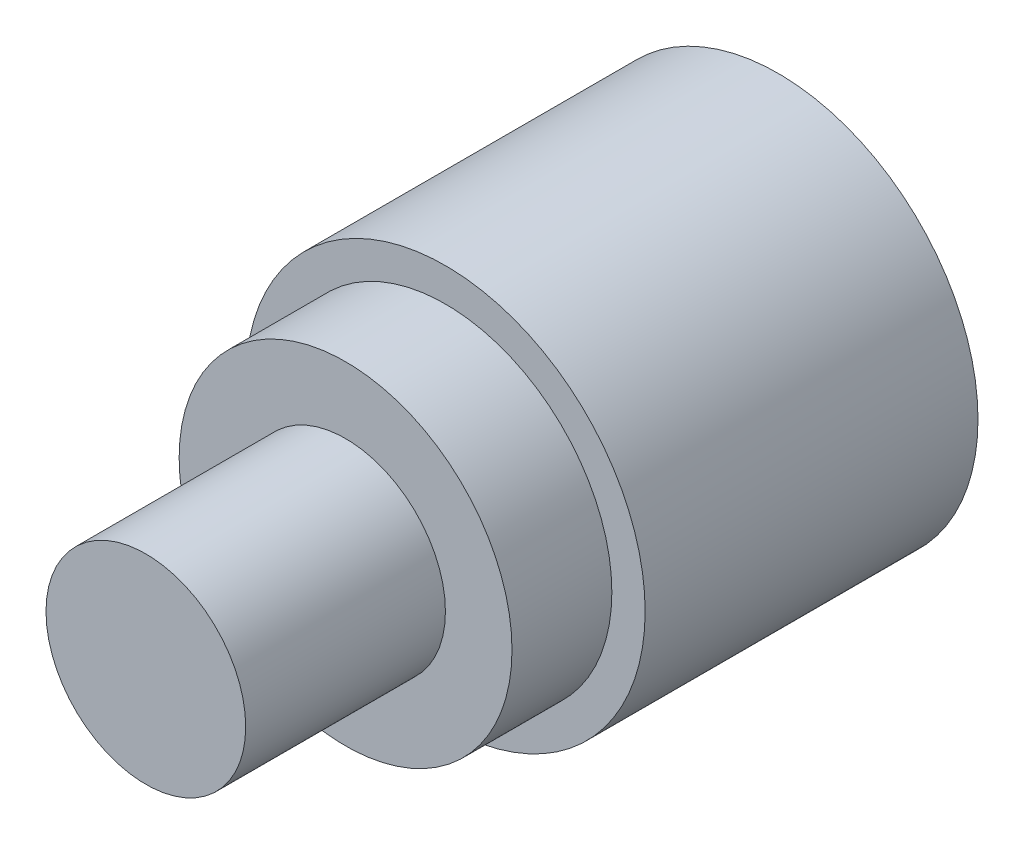
ISO-10303-21;
HEADER;
FILE_DESCRIPTION(('STEP AP214'),'2;1');
FILE_NAME('part.step','',(''),(''),'','','');
FILE_SCHEMA(('AUTOMOTIVE_DESIGN { 1 0 10303 214 1 1 1 1 }'));
ENDSEC;
DATA;
#1=APPLICATION_CONTEXT('core data for automotive mechanical design processes');
#2=APPLICATION_PROTOCOL_DEFINITION('international standard','automotive_design',2000,#1);
#3=PRODUCT_CONTEXT('',#1,'mechanical');
#4=PRODUCT('Part','Part','',(#3));
#5=PRODUCT_RELATED_PRODUCT_CATEGORY('part','',(#4));
#6=PRODUCT_DEFINITION_FORMATION('','',#4);
#7=PRODUCT_DEFINITION_CONTEXT('part definition',#1,'design');
#8=PRODUCT_DEFINITION('design','',#6,#7);
#9=PRODUCT_DEFINITION_SHAPE('','',#8);
#10=(LENGTH_UNIT() NAMED_UNIT(*) SI_UNIT(.MILLI.,.METRE.));
#11=(NAMED_UNIT(*) PLANE_ANGLE_UNIT() SI_UNIT($,.RADIAN.));
#12=(NAMED_UNIT(*) SI_UNIT($,.STERADIAN.) SOLID_ANGLE_UNIT());
#13=UNCERTAINTY_MEASURE_WITH_UNIT(LENGTH_MEASURE(1.E-05),#10,'distance_accuracy_value','');
#14=(GEOMETRIC_REPRESENTATION_CONTEXT(3) GLOBAL_UNCERTAINTY_ASSIGNED_CONTEXT((#13)) GLOBAL_UNIT_ASSIGNED_CONTEXT((#10,
#11,#12)) REPRESENTATION_CONTEXT('',''));
#15=CARTESIAN_POINT('',(0.,0.,0.));
#16=DIRECTION('',(0.,0.,1.));
#17=DIRECTION('',(1.,0.,0.));
#18=AXIS2_PLACEMENT_3D('',#15,#16,#17);
#19=CARTESIAN_POINT('',(0.,0.,40.));
#20=DIRECTION('',(0.,0.,1.));
#21=DIRECTION('',(1.,0.,0.));
#22=AXIS2_PLACEMENT_3D('',#19,#20,#21);
#23=PLANE('',#22);
#24=CARTESIAN_POINT('',(0.,0.,40.));
#25=DIRECTION('',(0.,0.,1.));
#26=DIRECTION('',(1.,0.,0.));
#27=AXIS2_PLACEMENT_3D('',#24,#25,#26);
#28=CIRCLE('',#27,25.);
#29=CARTESIAN_POINT('',(25.,0.,40.));
#30=VERTEX_POINT('',#29);
#31=EDGE_CURVE('E43',#30,#30,#28,.T.);
#32=ORIENTED_EDGE('',*,*,#31,.T.);
#33=EDGE_LOOP('',(#32));
#34=FACE_BOUND('',#33,.T.);
#35=CARTESIAN_POINT('',(0.,0.,40.));
#36=DIRECTION('',(0.,0.,1.));
#37=DIRECTION('',(1.,0.,0.));
#38=AXIS2_PLACEMENT_3D('',#35,#36,#37);
#39=CIRCLE('',#38,15.);
#40=CARTESIAN_POINT('',(15.,0.,40.));
#41=VERTEX_POINT('',#40);
#42=EDGE_CURVE('E51',#41,#41,#39,.T.);
#43=ORIENTED_EDGE('',*,*,#42,.F.);
#44=EDGE_LOOP('',(#43));
#45=FACE_BOUND('',#44,.T.);
#46=ADVANCED_FACE('F32',(#34,#45),#23,.T.);
#47=CARTESIAN_POINT('',(0.,0.,25.));
#48=DIRECTION('',(0.,0.,1.));
#49=DIRECTION('',(1.,0.,0.));
#50=AXIS2_PLACEMENT_3D('',#47,#48,#49);
#51=PLANE('',#50);
#52=CARTESIAN_POINT('',(0.,0.,25.));
#53=DIRECTION('',(0.,0.,1.));
#54=DIRECTION('',(1.,0.,0.));
#55=AXIS2_PLACEMENT_3D('',#52,#53,#54);
#56=CIRCLE('',#55,30.);
#57=CARTESIAN_POINT('',(30.,0.,25.));
#58=VERTEX_POINT('',#57);
#59=EDGE_CURVE('E10',#58,#58,#56,.T.);
#60=ORIENTED_EDGE('',*,*,#59,.T.);
#61=EDGE_LOOP('',(#60));
#62=FACE_BOUND('',#61,.T.);
#63=CARTESIAN_POINT('',(0.,0.,25.));
#64=DIRECTION('',(0.,0.,1.));
#65=DIRECTION('',(1.,0.,0.));
#66=AXIS2_PLACEMENT_3D('',#63,#64,#65);
#67=CIRCLE('',#66,25.);
#68=CARTESIAN_POINT('',(25.,0.,25.));
#69=VERTEX_POINT('',#68);
#70=EDGE_CURVE('E45',#69,#69,#67,.T.);
#71=ORIENTED_EDGE('',*,*,#70,.F.);
#72=EDGE_LOOP('',(#71));
#73=FACE_BOUND('',#72,.T.);
#74=ADVANCED_FACE('F67',(#62,#73),#51,.T.);
#75=CARTESIAN_POINT('',(0.,0.,25.));
#76=DIRECTION('',(0.,0.,-1.));
#77=DIRECTION('',(-1.,0.,0.));
#78=AXIS2_PLACEMENT_3D('',#75,#76,#77);
#79=CYLINDRICAL_SURFACE('',#78,30.);
#80=ORIENTED_EDGE('',*,*,#59,.F.);
#81=EDGE_LOOP('',(#80));
#82=FACE_BOUND('',#81,.T.);
#83=CARTESIAN_POINT('',(0.,0.,-25.));
#84=DIRECTION('',(0.,0.,1.));
#85=DIRECTION('',(1.,0.,0.));
#86=AXIS2_PLACEMENT_3D('',#83,#84,#85);
#87=CIRCLE('',#86,30.);
#88=CARTESIAN_POINT('',(30.,0.,-25.));
#89=VERTEX_POINT('',#88);
#90=EDGE_CURVE('E36',#89,#89,#87,.T.);
#91=ORIENTED_EDGE('',*,*,#90,.T.);
#92=EDGE_LOOP('',(#91));
#93=FACE_BOUND('',#92,.T.);
#94=ADVANCED_FACE('F34',(#82,#93),#79,.T.);
#95=CARTESIAN_POINT('',(0.,0.,-25.));
#96=DIRECTION('',(0.,0.,1.));
#97=DIRECTION('',(1.,0.,0.));
#98=AXIS2_PLACEMENT_3D('',#95,#96,#97);
#99=PLANE('',#98);
#100=ORIENTED_EDGE('',*,*,#90,.F.);
#101=EDGE_LOOP('',(#100));
#102=FACE_BOUND('',#101,.T.);
#103=ADVANCED_FACE('F77',(#102),#99,.F.);
#104=CARTESIAN_POINT('',(0.,0.,40.));
#105=DIRECTION('',(0.,0.,-1.));
#106=DIRECTION('',(-1.,0.,0.));
#107=AXIS2_PLACEMENT_3D('',#104,#105,#106);
#108=CYLINDRICAL_SURFACE('',#107,25.);
#109=ORIENTED_EDGE('',*,*,#31,.F.);
#110=EDGE_LOOP('',(#109));
#111=FACE_BOUND('',#110,.T.);
#112=ORIENTED_EDGE('',*,*,#70,.T.);
#113=EDGE_LOOP('',(#112));
#114=FACE_BOUND('',#113,.T.);
#115=ADVANCED_FACE('F62',(#111,#114),#108,.T.);
#116=CARTESIAN_POINT('',(0.,0.,70.));
#117=DIRECTION('',(0.,0.,-1.));
#118=DIRECTION('',(-1.,0.,0.));
#119=AXIS2_PLACEMENT_3D('',#116,#117,#118);
#120=CYLINDRICAL_SURFACE('',#119,15.);
#121=CARTESIAN_POINT('',(0.,0.,70.));
#122=DIRECTION('',(0.,0.,1.));
#123=DIRECTION('',(1.,0.,0.));
#124=AXIS2_PLACEMENT_3D('',#121,#122,#123);
#125=CIRCLE('',#124,15.);
#126=CARTESIAN_POINT('',(15.,0.,70.));
#127=VERTEX_POINT('',#126);
#128=EDGE_CURVE('E48',#127,#127,#125,.T.);
#129=ORIENTED_EDGE('',*,*,#128,.F.);
#130=EDGE_LOOP('',(#129));
#131=FACE_BOUND('',#130,.T.);
#132=ORIENTED_EDGE('',*,*,#42,.T.);
#133=EDGE_LOOP('',(#132));
#134=FACE_BOUND('',#133,.T.);
#135=ADVANCED_FACE('F59',(#131,#134),#120,.T.);
#136=CARTESIAN_POINT('',(0.,0.,70.));
#137=DIRECTION('',(0.,0.,1.));
#138=DIRECTION('',(1.,0.,0.));
#139=AXIS2_PLACEMENT_3D('',#136,#137,#138);
#140=PLANE('',#139);
#141=ORIENTED_EDGE('',*,*,#128,.T.);
#142=EDGE_LOOP('',(#141));
#143=FACE_BOUND('',#142,.T.);
#144=ADVANCED_FACE('F57',(#143),#140,.T.);
#145=CLOSED_SHELL('',(#46,#74,#94,#103,#115,#135,#144));
#146=MANIFOLD_SOLID_BREP('B2',#145);
#147=ADVANCED_BREP_SHAPE_REPRESENTATION('',(#18,#146),#14);
#148=SHAPE_DEFINITION_REPRESENTATION(#9,#147);
ENDSEC;
END-ISO-10303-21;
